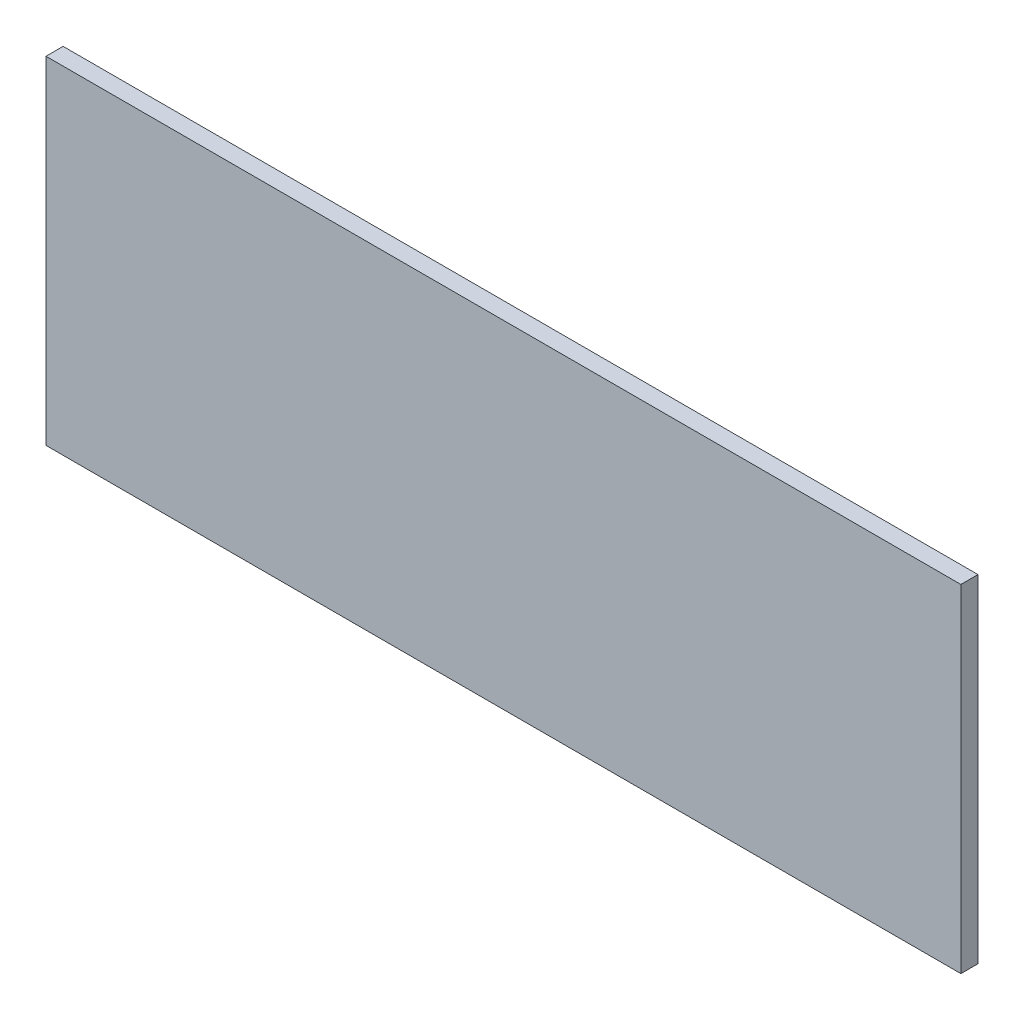
ISO-10303-21;
HEADER;
FILE_DESCRIPTION(('STEP AP214'),'2;1');
FILE_NAME('part.step','',(''),(''),'','','');
FILE_SCHEMA(('AUTOMOTIVE_DESIGN { 1 0 10303 214 1 1 1 1 }'));
ENDSEC;
DATA;
#1=APPLICATION_CONTEXT('core data for automotive mechanical design processes');
#2=APPLICATION_PROTOCOL_DEFINITION('international standard','automotive_design',2000,#1);
#3=PRODUCT_CONTEXT('',#1,'mechanical');
#4=PRODUCT('Part','Part','',(#3));
#5=PRODUCT_RELATED_PRODUCT_CATEGORY('part','',(#4));
#6=PRODUCT_DEFINITION_FORMATION('','',#4);
#7=PRODUCT_DEFINITION_CONTEXT('part definition',#1,'design');
#8=PRODUCT_DEFINITION('design','',#6,#7);
#9=PRODUCT_DEFINITION_SHAPE('','',#8);
#10=(LENGTH_UNIT() NAMED_UNIT(*) SI_UNIT(.MILLI.,.METRE.));
#11=(NAMED_UNIT(*) PLANE_ANGLE_UNIT() SI_UNIT($,.RADIAN.));
#12=(NAMED_UNIT(*) SI_UNIT($,.STERADIAN.) SOLID_ANGLE_UNIT());
#13=UNCERTAINTY_MEASURE_WITH_UNIT(LENGTH_MEASURE(1.E-05),#10,'distance_accuracy_value','');
#14=(GEOMETRIC_REPRESENTATION_CONTEXT(3) GLOBAL_UNCERTAINTY_ASSIGNED_CONTEXT((#13)) GLOBAL_UNIT_ASSIGNED_CONTEXT((#10,
#11,#12)) REPRESENTATION_CONTEXT('',''));
#15=CARTESIAN_POINT('',(0.,0.,0.));
#16=DIRECTION('',(0.,0.,1.));
#17=DIRECTION('',(1.,0.,0.));
#18=AXIS2_PLACEMENT_3D('',#15,#16,#17);
#19=CARTESIAN_POINT('',(81.8669967651367,62.5870018005371,0.));
#20=DIRECTION('',(0.,1.,0.));
#21=DIRECTION('',(1.,0.,0.));
#22=AXIS2_PLACEMENT_3D('',#19,#20,#21);
#23=PLANE('',#22);
#24=DIRECTION('',(1.,0.,0.));
#25=VECTOR('',#24,1.);
#26=CARTESIAN_POINT('',(81.8669967651367,62.5870018005371,0.03556));
#27=LINE('',#26,#25);
#28=CARTESIAN_POINT('',(81.8669967651367,62.5870018005371,0.03556));
#29=VERTEX_POINT('',#28);
#30=CARTESIAN_POINT('',(83.7669982910156,62.5870018005371,0.03556));
#31=VERTEX_POINT('',#30);
#32=EDGE_CURVE('E11',#29,#31,#27,.T.);
#33=ORIENTED_EDGE('',*,*,#32,.F.);
#34=DIRECTION('',(0.,0.,1.));
#35=VECTOR('',#34,1.);
#36=CARTESIAN_POINT('',(81.8669967651367,62.5870018005371,0.));
#37=LINE('',#36,#35);
#38=CARTESIAN_POINT('',(81.8669967651367,62.5870018005371,0.));
#39=VERTEX_POINT('',#38);
#40=EDGE_CURVE('E24',#39,#29,#37,.T.);
#41=ORIENTED_EDGE('',*,*,#40,.F.);
#42=DIRECTION('',(1.,0.,0.));
#43=VECTOR('',#42,1.);
#44=CARTESIAN_POINT('',(81.8669967651367,62.5870018005371,0.));
#45=LINE('',#44,#43);
#46=CARTESIAN_POINT('',(83.7669982910156,62.5870018005371,0.));
#47=VERTEX_POINT('',#46);
#48=EDGE_CURVE('E75',#39,#47,#45,.T.);
#49=ORIENTED_EDGE('',*,*,#48,.T.);
#50=DIRECTION('',(0.,0.,1.));
#51=VECTOR('',#50,1.);
#52=CARTESIAN_POINT('',(83.7669982910156,62.5870018005371,0.));
#53=LINE('',#52,#51);
#54=EDGE_CURVE('E37',#47,#31,#53,.T.);
#55=ORIENTED_EDGE('',*,*,#54,.T.);
#56=EDGE_LOOP('',(#33,#41,#49,#55));
#57=FACE_BOUND('',#56,.T.);
#58=ADVANCED_FACE('F17',(#57),#23,.F.);
#59=CARTESIAN_POINT('',(83.7669982910156,62.5870018005371,0.));
#60=DIRECTION('',(-1.,0.,0.));
#61=DIRECTION('',(0.,1.,0.));
#62=AXIS2_PLACEMENT_3D('',#59,#60,#61);
#63=PLANE('',#62);
#64=DIRECTION('',(0.,1.,0.));
#65=VECTOR('',#64,1.);
#66=CARTESIAN_POINT('',(83.7669982910156,62.5870018005371,0.03556));
#67=LINE('',#66,#65);
#68=CARTESIAN_POINT('',(83.7669982910156,63.2869987487793,0.03556));
#69=VERTEX_POINT('',#68);
#70=EDGE_CURVE('E83',#31,#69,#67,.T.);
#71=ORIENTED_EDGE('',*,*,#70,.F.);
#72=ORIENTED_EDGE('',*,*,#54,.F.);
#73=DIRECTION('',(0.,1.,0.));
#74=VECTOR('',#73,1.);
#75=CARTESIAN_POINT('',(83.7669982910156,62.5870018005371,0.));
#76=LINE('',#75,#74);
#77=CARTESIAN_POINT('',(83.7669982910156,63.2869987487793,0.));
#78=VERTEX_POINT('',#77);
#79=EDGE_CURVE('E81',#47,#78,#76,.T.);
#80=ORIENTED_EDGE('',*,*,#79,.T.);
#81=DIRECTION('',(0.,0.,1.));
#82=VECTOR('',#81,1.);
#83=CARTESIAN_POINT('',(83.7669982910156,63.2869987487793,0.));
#84=LINE('',#83,#82);
#85=EDGE_CURVE('E67',#78,#69,#84,.T.);
#86=ORIENTED_EDGE('',*,*,#85,.T.);
#87=EDGE_LOOP('',(#71,#72,#80,#86));
#88=FACE_BOUND('',#87,.T.);
#89=ADVANCED_FACE('F89',(#88),#63,.F.);
#90=CARTESIAN_POINT('',(83.7669982910156,63.2869987487793,0.));
#91=DIRECTION('',(0.,-1.,0.));
#92=DIRECTION('',(-1.,0.,0.));
#93=AXIS2_PLACEMENT_3D('',#90,#91,#92);
#94=PLANE('',#93);
#95=DIRECTION('',(-1.,0.,0.));
#96=VECTOR('',#95,1.);
#97=CARTESIAN_POINT('',(83.7669982910156,63.2869987487793,0.03556));
#98=LINE('',#97,#96);
#99=CARTESIAN_POINT('',(81.8669967651367,63.2869987487793,0.03556));
#100=VERTEX_POINT('',#99);
#101=EDGE_CURVE('E71',#69,#100,#98,.T.);
#102=ORIENTED_EDGE('',*,*,#101,.F.);
#103=ORIENTED_EDGE('',*,*,#85,.F.);
#104=DIRECTION('',(-1.,0.,0.));
#105=VECTOR('',#104,1.);
#106=CARTESIAN_POINT('',(83.7669982910156,63.2869987487793,0.));
#107=LINE('',#106,#105);
#108=CARTESIAN_POINT('',(81.8669967651367,63.2869987487793,0.));
#109=VERTEX_POINT('',#108);
#110=EDGE_CURVE('E63',#78,#109,#107,.T.);
#111=ORIENTED_EDGE('',*,*,#110,.T.);
#112=DIRECTION('',(0.,0.,1.));
#113=VECTOR('',#112,1.);
#114=CARTESIAN_POINT('',(81.8669967651367,63.2869987487793,0.));
#115=LINE('',#114,#113);
#116=EDGE_CURVE('E53',#109,#100,#115,.T.);
#117=ORIENTED_EDGE('',*,*,#116,.T.);
#118=EDGE_LOOP('',(#102,#103,#111,#117));
#119=FACE_BOUND('',#118,.T.);
#120=ADVANCED_FACE('F66',(#119),#94,.F.);
#121=CARTESIAN_POINT('',(81.8669967651367,63.2869987487793,0.));
#122=DIRECTION('',(1.,0.,0.));
#123=DIRECTION('',(0.,-1.,0.));
#124=AXIS2_PLACEMENT_3D('',#121,#122,#123);
#125=PLANE('',#124);
#126=DIRECTION('',(0.,-1.,0.));
#127=VECTOR('',#126,1.);
#128=CARTESIAN_POINT('',(81.8669967651367,63.2869987487793,0.03556));
#129=LINE('',#128,#127);
#130=EDGE_CURVE('E59',#100,#29,#129,.T.);
#131=ORIENTED_EDGE('',*,*,#130,.F.);
#132=ORIENTED_EDGE('',*,*,#116,.F.);
#133=DIRECTION('',(0.,-1.,0.));
#134=VECTOR('',#133,1.);
#135=CARTESIAN_POINT('',(81.8669967651367,63.2869987487793,0.));
#136=LINE('',#135,#134);
#137=EDGE_CURVE('E57',#109,#39,#136,.T.);
#138=ORIENTED_EDGE('',*,*,#137,.T.);
#139=ORIENTED_EDGE('',*,*,#40,.T.);
#140=EDGE_LOOP('',(#131,#132,#138,#139));
#141=FACE_BOUND('',#140,.T.);
#142=ADVANCED_FACE('F55',(#141),#125,.F.);
#143=CARTESIAN_POINT('',(81.8669967651367,62.5870018005371,0.));
#144=DIRECTION('',(0.,0.,-1.));
#145=DIRECTION('',(-1.,0.,0.));
#146=AXIS2_PLACEMENT_3D('',#143,#144,#145);
#147=PLANE('',#146);
#148=ORIENTED_EDGE('',*,*,#137,.F.);
#149=ORIENTED_EDGE('',*,*,#110,.F.);
#150=ORIENTED_EDGE('',*,*,#79,.F.);
#151=ORIENTED_EDGE('',*,*,#48,.F.);
#152=EDGE_LOOP('',(#148,#149,#150,#151));
#153=FACE_BOUND('',#152,.T.);
#154=ADVANCED_FACE('F74',(#153),#147,.T.);
#155=CARTESIAN_POINT('',(81.8669967651367,62.5870018005371,0.03556));
#156=DIRECTION('',(0.,0.,-1.));
#157=DIRECTION('',(-1.,0.,0.));
#158=AXIS2_PLACEMENT_3D('',#155,#156,#157);
#159=PLANE('',#158);
#160=ORIENTED_EDGE('',*,*,#32,.T.);
#161=ORIENTED_EDGE('',*,*,#70,.T.);
#162=ORIENTED_EDGE('',*,*,#101,.T.);
#163=ORIENTED_EDGE('',*,*,#130,.T.);
#164=EDGE_LOOP('',(#160,#161,#162,#163));
#165=FACE_BOUND('',#164,.T.);
#166=ADVANCED_FACE('F91',(#165),#159,.F.);
#167=CLOSED_SHELL('',(#58,#89,#120,#142,#154,#166));
#168=MANIFOLD_SOLID_BREP('B1',#167);
#169=ADVANCED_BREP_SHAPE_REPRESENTATION('',(#18,#168),#14);
#170=SHAPE_DEFINITION_REPRESENTATION(#9,#169);
ENDSEC;
END-ISO-10303-21;
